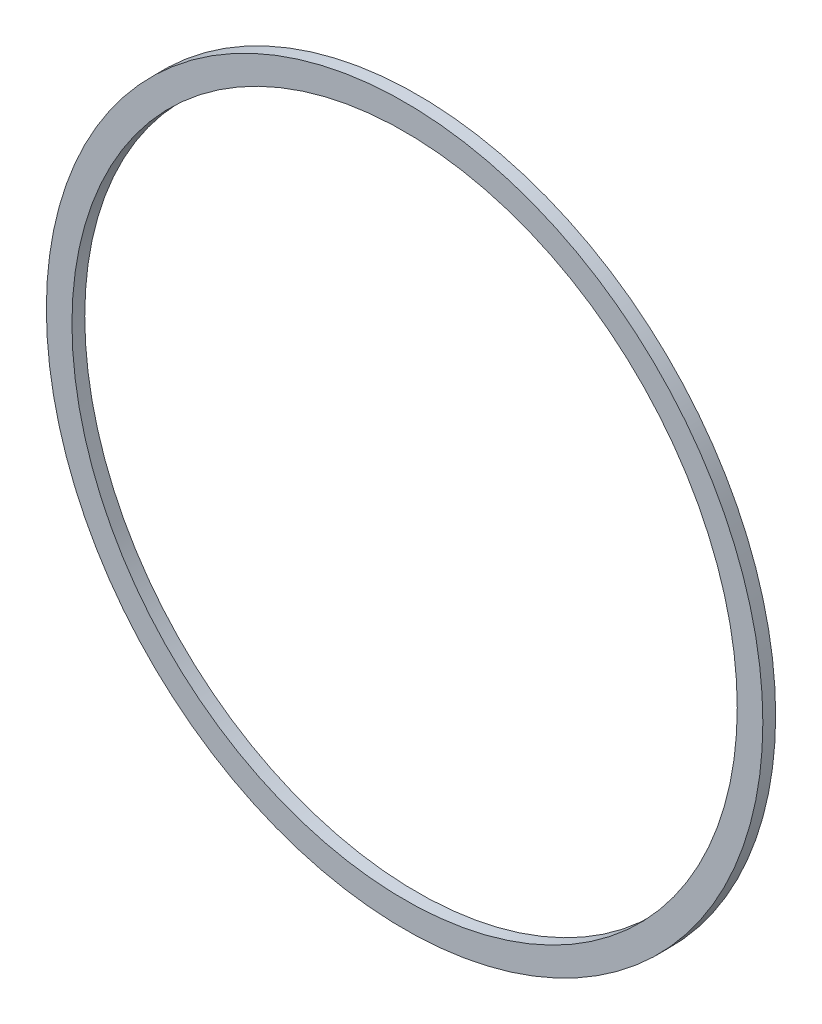
ISO-10303-21;
HEADER;
FILE_DESCRIPTION(('STEP AP214'),'2;1');
FILE_NAME('part.step','',(''),(''),'','','');
FILE_SCHEMA(('AUTOMOTIVE_DESIGN { 1 0 10303 214 1 1 1 1 }'));
ENDSEC;
DATA;
#1=APPLICATION_CONTEXT('core data for automotive mechanical design processes');
#2=APPLICATION_PROTOCOL_DEFINITION('international standard','automotive_design',2000,#1);
#3=PRODUCT_CONTEXT('',#1,'mechanical');
#4=PRODUCT('Part','Part','',(#3));
#5=PRODUCT_RELATED_PRODUCT_CATEGORY('part','',(#4));
#6=PRODUCT_DEFINITION_FORMATION('','',#4);
#7=PRODUCT_DEFINITION_CONTEXT('part definition',#1,'design');
#8=PRODUCT_DEFINITION('design','',#6,#7);
#9=PRODUCT_DEFINITION_SHAPE('','',#8);
#10=(LENGTH_UNIT() NAMED_UNIT(*) SI_UNIT(.MILLI.,.METRE.));
#11=(NAMED_UNIT(*) PLANE_ANGLE_UNIT() SI_UNIT($,.RADIAN.));
#12=(NAMED_UNIT(*) SI_UNIT($,.STERADIAN.) SOLID_ANGLE_UNIT());
#13=UNCERTAINTY_MEASURE_WITH_UNIT(LENGTH_MEASURE(1.E-05),#10,'distance_accuracy_value','');
#14=(GEOMETRIC_REPRESENTATION_CONTEXT(3) GLOBAL_UNCERTAINTY_ASSIGNED_CONTEXT((#13)) GLOBAL_UNIT_ASSIGNED_CONTEXT((#10,
#11,#12)) REPRESENTATION_CONTEXT('',''));
#15=CARTESIAN_POINT('',(0.,0.,0.));
#16=DIRECTION('',(0.,0.,1.));
#17=DIRECTION('',(1.,0.,0.));
#18=AXIS2_PLACEMENT_3D('',#15,#16,#17);
#19=CARTESIAN_POINT('',(0.,0.,1.));
#20=DIRECTION('',(0.,0.,1.));
#21=DIRECTION('',(1.,0.,0.));
#22=AXIS2_PLACEMENT_3D('',#19,#20,#21);
#23=PLANE('',#22);
#24=CARTESIAN_POINT('',(0.,0.,1.));
#25=DIRECTION('',(0.,0.,1.));
#26=DIRECTION('',(1.,0.,0.));
#27=AXIS2_PLACEMENT_3D('',#24,#25,#26);
#28=CIRCLE('',#27,28.);
#29=CARTESIAN_POINT('',(28.,0.,1.));
#30=VERTEX_POINT('',#29);
#31=EDGE_CURVE('E10',#30,#30,#28,.T.);
#32=ORIENTED_EDGE('',*,*,#31,.T.);
#33=EDGE_LOOP('',(#32));
#34=FACE_BOUND('',#33,.T.);
#35=CARTESIAN_POINT('',(0.,0.,1.));
#36=DIRECTION('',(0.,0.,1.));
#37=DIRECTION('',(1.,0.,0.));
#38=AXIS2_PLACEMENT_3D('',#35,#36,#37);
#39=CIRCLE('',#38,26.);
#40=CARTESIAN_POINT('',(26.,0.,1.));
#41=VERTEX_POINT('',#40);
#42=EDGE_CURVE('E50',#41,#41,#39,.T.);
#43=ORIENTED_EDGE('',*,*,#42,.F.);
#44=EDGE_LOOP('',(#43));
#45=FACE_BOUND('',#44,.T.);
#46=ADVANCED_FACE('F37',(#34,#45),#23,.T.);
#47=CARTESIAN_POINT('',(0.,0.,0.));
#48=DIRECTION('',(0.,0.,1.));
#49=DIRECTION('',(1.,0.,0.));
#50=AXIS2_PLACEMENT_3D('',#47,#48,#49);
#51=PLANE('',#50);
#52=CARTESIAN_POINT('',(0.,0.,0.));
#53=DIRECTION('',(0.,0.,1.));
#54=DIRECTION('',(1.,0.,0.));
#55=AXIS2_PLACEMENT_3D('',#52,#53,#54);
#56=CIRCLE('',#55,28.);
#57=CARTESIAN_POINT('',(28.,0.,0.));
#58=VERTEX_POINT('',#57);
#59=EDGE_CURVE('E41',#58,#58,#56,.T.);
#60=ORIENTED_EDGE('',*,*,#59,.F.);
#61=EDGE_LOOP('',(#60));
#62=FACE_BOUND('',#61,.T.);
#63=CARTESIAN_POINT('',(0.,0.,0.));
#64=DIRECTION('',(0.,0.,1.));
#65=DIRECTION('',(1.,0.,0.));
#66=AXIS2_PLACEMENT_3D('',#63,#64,#65);
#67=CIRCLE('',#66,26.);
#68=CARTESIAN_POINT('',(26.,0.,0.));
#69=VERTEX_POINT('',#68);
#70=EDGE_CURVE('E52',#69,#69,#67,.T.);
#71=ORIENTED_EDGE('',*,*,#70,.T.);
#72=EDGE_LOOP('',(#71));
#73=FACE_BOUND('',#72,.T.);
#74=ADVANCED_FACE('F64',(#62,#73),#51,.F.);
#75=CARTESIAN_POINT('',(0.,0.,1.));
#76=DIRECTION('',(0.,0.,-1.));
#77=DIRECTION('',(-1.,0.,0.));
#78=AXIS2_PLACEMENT_3D('',#75,#76,#77);
#79=CYLINDRICAL_SURFACE('',#78,28.);
#80=ORIENTED_EDGE('',*,*,#31,.F.);
#81=EDGE_LOOP('',(#80));
#82=FACE_BOUND('',#81,.T.);
#83=ORIENTED_EDGE('',*,*,#59,.T.);
#84=EDGE_LOOP('',(#83));
#85=FACE_BOUND('',#84,.T.);
#86=ADVANCED_FACE('F39',(#82,#85),#79,.T.);
#87=CARTESIAN_POINT('',(0.,0.,1.));
#88=DIRECTION('',(0.,0.,-1.));
#89=DIRECTION('',(-1.,0.,0.));
#90=AXIS2_PLACEMENT_3D('',#87,#88,#89);
#91=CYLINDRICAL_SURFACE('',#90,26.);
#92=ORIENTED_EDGE('',*,*,#42,.T.);
#93=EDGE_LOOP('',(#92));
#94=FACE_BOUND('',#93,.T.);
#95=ORIENTED_EDGE('',*,*,#70,.F.);
#96=EDGE_LOOP('',(#95));
#97=FACE_BOUND('',#96,.T.);
#98=ADVANCED_FACE('F60',(#94,#97),#91,.F.);
#99=CLOSED_SHELL('',(#46,#74,#86,#98));
#100=MANIFOLD_SOLID_BREP('B2',#99);
#101=ADVANCED_BREP_SHAPE_REPRESENTATION('',(#18,#100),#14);
#102=SHAPE_DEFINITION_REPRESENTATION(#9,#101);
ENDSEC;
END-ISO-10303-21;
